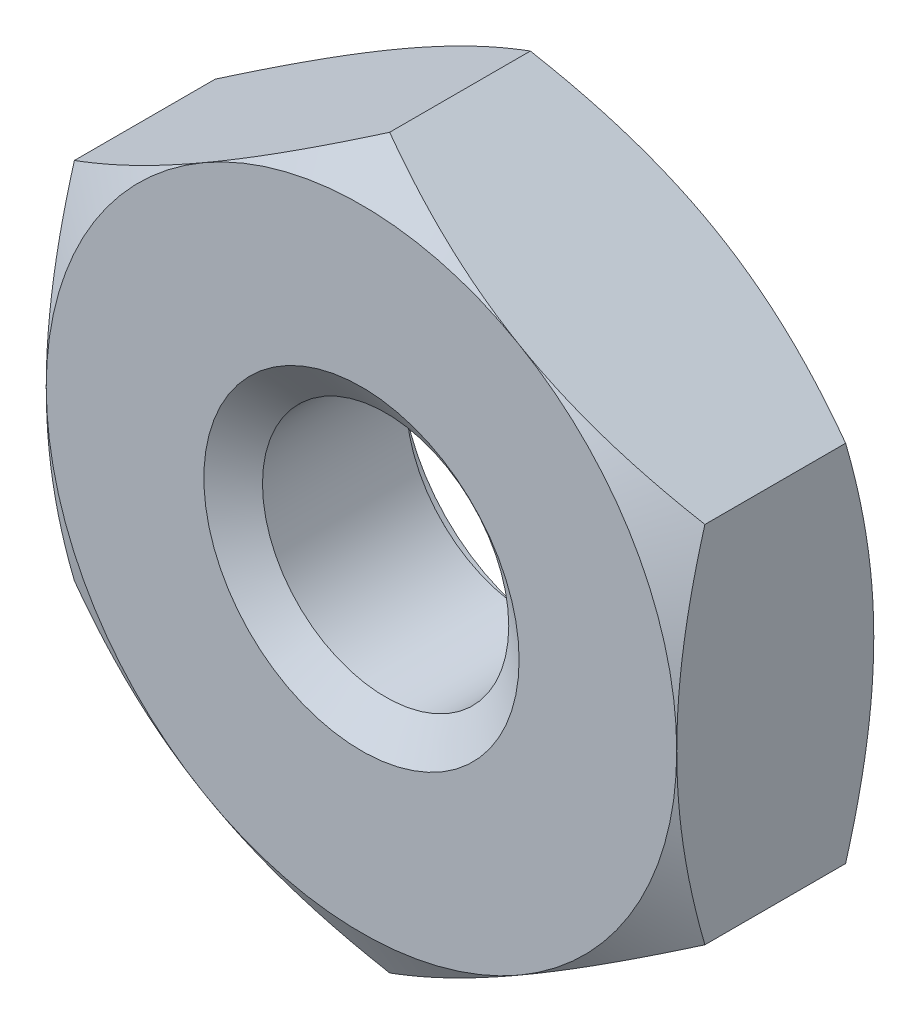
ISO-10303-21;
HEADER;
FILE_DESCRIPTION(('STEP AP214'),'2;1');
FILE_NAME('part.step','',(''),(''),'','','');
FILE_SCHEMA(('AUTOMOTIVE_DESIGN { 1 0 10303 214 1 1 1 1 }'));
ENDSEC;
DATA;
#1=APPLICATION_CONTEXT('core data for automotive mechanical design processes');
#2=APPLICATION_PROTOCOL_DEFINITION('international standard','automotive_design',2000,#1);
#3=PRODUCT_CONTEXT('',#1,'mechanical');
#4=PRODUCT('Part','Part','',(#3));
#5=PRODUCT_RELATED_PRODUCT_CATEGORY('part','',(#4));
#6=PRODUCT_DEFINITION_FORMATION('','',#4);
#7=PRODUCT_DEFINITION_CONTEXT('part definition',#1,'design');
#8=PRODUCT_DEFINITION('design','',#6,#7);
#9=PRODUCT_DEFINITION_SHAPE('','',#8);
#10=(LENGTH_UNIT() NAMED_UNIT(*) SI_UNIT(.MILLI.,.METRE.));
#11=(NAMED_UNIT(*) PLANE_ANGLE_UNIT() SI_UNIT($,.RADIAN.));
#12=(NAMED_UNIT(*) SI_UNIT($,.STERADIAN.) SOLID_ANGLE_UNIT());
#13=UNCERTAINTY_MEASURE_WITH_UNIT(LENGTH_MEASURE(1.E-05),#10,'distance_accuracy_value','');
#14=(GEOMETRIC_REPRESENTATION_CONTEXT(3) GLOBAL_UNCERTAINTY_ASSIGNED_CONTEXT((#13)) GLOBAL_UNIT_ASSIGNED_CONTEXT((#10,
#11,#12)) REPRESENTATION_CONTEXT('',''));
#15=CARTESIAN_POINT('',(0.,0.,0.));
#16=DIRECTION('',(0.,0.,1.));
#17=DIRECTION('',(1.,0.,0.));
#18=AXIS2_PLACEMENT_3D('',#15,#16,#17);
#19=CARTESIAN_POINT('',(0.,0.,-1.));
#20=DIRECTION('',(0.,0.,1.));
#21=DIRECTION('',(1.,0.,0.));
#22=AXIS2_PLACEMENT_3D('',#19,#20,#21);
#23=CYLINDRICAL_SURFACE('',#22,0.625);
#24=CARTESIAN_POINT('',(0.,0.,-0.122536319186698));
#25=DIRECTION('',(0.,0.,1.));
#26=DIRECTION('',(1.,0.,0.));
#27=AXIS2_PLACEMENT_3D('',#24,#25,#26);
#28=CIRCLE('',#27,0.625);
#29=CARTESIAN_POINT('',(0.625,0.,-0.122536319186698));
#30=VERTEX_POINT('',#29);
#31=EDGE_CURVE('E180',#30,#30,#28,.F.);
#32=ORIENTED_EDGE('',*,*,#31,.F.);
#33=EDGE_LOOP('',(#32));
#34=FACE_BOUND('',#33,.T.);
#35=CARTESIAN_POINT('',(0.,0.,-0.852063680813301));
#36=DIRECTION('',(0.,0.,-1.));
#37=DIRECTION('',(-1.,0.,0.));
#38=AXIS2_PLACEMENT_3D('',#35,#36,#37);
#39=CIRCLE('',#38,0.625);
#40=CARTESIAN_POINT('',(-0.625,0.,-0.852063680813301));
#41=VERTEX_POINT('',#40);
#42=EDGE_CURVE('E44',#41,#41,#39,.F.);
#43=ORIENTED_EDGE('',*,*,#42,.F.);
#44=EDGE_LOOP('',(#43));
#45=FACE_BOUND('',#44,.T.);
#46=ADVANCED_FACE('F39',(#34,#45),#23,.F.);
#47=CARTESIAN_POINT('',(0.,1.8475208614068,-1.));
#48=DIRECTION('',(-0.500000000000002,0.866025403784438,0.));
#49=DIRECTION('',(-0.866025403784438,-0.500000000000001,0.));
#50=AXIS2_PLACEMENT_3D('',#47,#48,#49);
#51=PLANE('',#50);
#52=DIRECTION('',(0.,0.,1.));
#53=VECTOR('',#52,1.);
#54=CARTESIAN_POINT('',(-1.6,0.923760430703399,-1.));
#55=LINE('',#54,#53);
#56=CARTESIAN_POINT('',(-1.6,0.923760430703405,-0.857093764036733));
#57=VERTEX_POINT('',#56);
#58=CARTESIAN_POINT('',(-1.6,0.923760430703399,-0.142906235963265));
#59=VERTEX_POINT('',#58);
#60=EDGE_CURVE('E170',#57,#59,#55,.T.);
#61=ORIENTED_EDGE('',*,*,#60,.T.);
#62=CARTESIAN_POINT('',(-1.6002,0.923644960649562,-0.142972908879542));
#63=CARTESIAN_POINT('',(-1.52988631454261,0.964240585876099,-0.11952386935105));
#64=CARTESIAN_POINT('',(-1.45896568981644,1.00518662765285,-0.0981973588558103));
#65=CARTESIAN_POINT('',(-1.31589622208532,1.08778782336023,-0.0609706558641361));
#66=CARTESIAN_POINT('',(-1.24374483580213,1.12944444565323,-0.0450836346469226));
#67=CARTESIAN_POINT('',(-1.10033630057878,1.21224140206853,-0.0203517145647476));
#68=CARTESIAN_POINT('',(-1.02910122444319,1.25336899245115,-0.0113422364016103));
#69=CARTESIAN_POINT('',(-0.886295665767103,1.33581782019457,-0.000584271243997045));
#70=CARTESIAN_POINT('',(-0.814725702734542,1.37713875761731,0.00117312160481527));
#71=CARTESIAN_POINT('',(-0.680978543862274,1.45435771579556,-0.00247117305863149));
#72=CARTESIAN_POINT('',(-0.618781387401735,1.49026726082088,-0.0069780590876111));
#73=CARTESIAN_POINT('',(-0.494792313483937,1.56185238602389,-0.0212658761938087));
#74=CARTESIAN_POINT('',(-0.433000825294996,1.59752771836341,-0.0310516940962126));
#75=CARTESIAN_POINT('',(-0.308755841646641,1.66926059311825,-0.0555169113294943));
#76=CARTESIAN_POINT('',(-0.246318081755429,1.70530905059903,-0.0703000799228597));
#77=CARTESIAN_POINT('',(-0.122374128162257,1.77686812557048,-0.10385260778329));
#78=CARTESIAN_POINT('',(-0.0608663449577961,1.81237966076083,-0.122614076743965));
#79=CARTESIAN_POINT('',(0.000199999999999744,1.84763633146064,-0.142972908879543));
#80=B_SPLINE_CURVE_WITH_KNOTS('',3,(#62,#63,#64,#65,#66,#67,#68,#69,#70,#71,#72,#73,#74,#75,#76,
#77,#78,#79),.UNSPECIFIED.,.F.,.F.,(4,2,2,2,2,2,2,2,4),(0.,0.253628622662481,0.507867113505243,
0.755812447259193,1.00345320332839,1.21912891721902,1.43500463041921,1.65567058644228,
1.87590291418786),.UNSPECIFIED.);
#81=CARTESIAN_POINT('',(-0.800000000000002,1.3856406460551,0.));
#82=VERTEX_POINT('',#81);
#83=EDGE_CURVE('E66',#59,#82,#80,.T.);
#84=ORIENTED_EDGE('',*,*,#83,.T.);
#85=CARTESIAN_POINT('',(0.,1.8475208614068,-0.142906235963267));
#86=VERTEX_POINT('',#85);
#87=EDGE_CURVE('E249',#82,#86,#80,.T.);
#88=ORIENTED_EDGE('',*,*,#87,.T.);
#89=DIRECTION('',(0.,0.,1.));
#90=VECTOR('',#89,1.);
#91=CARTESIAN_POINT('',(0.,1.8475208614068,-1.));
#92=LINE('',#91,#90);
#93=CARTESIAN_POINT('',(0.,1.8475208614068,-0.857093764036733));
#94=VERTEX_POINT('',#93);
#95=EDGE_CURVE('E155',#94,#86,#92,.T.);
#96=ORIENTED_EDGE('',*,*,#95,.F.);
#97=CARTESIAN_POINT('',(-1.6002,0.923644960649562,-0.857027091120458));
#98=CARTESIAN_POINT('',(-1.52988631454261,0.964240585876099,-0.88047613064895));
#99=CARTESIAN_POINT('',(-1.45896568981644,1.00518662765285,-0.90180264114419));
#100=CARTESIAN_POINT('',(-1.31589622208532,1.08778782336023,-0.939029344135864));
#101=CARTESIAN_POINT('',(-1.24374483580213,1.12944444565323,-0.954916365353078));
#102=CARTESIAN_POINT('',(-1.10033630057878,1.21224140206853,-0.979648285435252));
#103=CARTESIAN_POINT('',(-1.02910122444319,1.25336899245115,-0.98865776359839));
#104=CARTESIAN_POINT('',(-0.886295665767103,1.33581782019457,-0.999415728756003));
#105=CARTESIAN_POINT('',(-0.814725702734542,1.37713875761731,-1.00117312160482));
#106=CARTESIAN_POINT('',(-0.680978543862274,1.45435771579556,-0.997528826941369));
#107=CARTESIAN_POINT('',(-0.618781387401735,1.49026726082088,-0.993021940912389));
#108=CARTESIAN_POINT('',(-0.494792313483937,1.56185238602389,-0.978734123806191));
#109=CARTESIAN_POINT('',(-0.433000825294996,1.59752771836341,-0.968948305903787));
#110=CARTESIAN_POINT('',(-0.308755841646641,1.66926059311825,-0.944483088670506));
#111=CARTESIAN_POINT('',(-0.246318081755429,1.70530905059903,-0.92969992007714));
#112=CARTESIAN_POINT('',(-0.122374128162257,1.77686812557048,-0.89614739221671));
#113=CARTESIAN_POINT('',(-0.0608663449577961,1.81237966076083,-0.877385923256035));
#114=CARTESIAN_POINT('',(0.000199999999999745,1.84763633146064,-0.857027091120457));
#115=B_SPLINE_CURVE_WITH_KNOTS('',3,(#97,#98,#99,#100,#101,#102,#103,#104,#105,#106,#107,#108,
#109,#110,#111,#112,#113,#114),.UNSPECIFIED.,.F.,.F.,(4,2,2,2,2,2,2,2,4),(0.,0.253628622662481,
0.507867113505243,0.755812447259193,1.00345320332839,1.21912891721902,1.43500463041921,
1.65567058644228,1.87590291418786),.UNSPECIFIED.);
#116=CARTESIAN_POINT('',(-0.800000000000002,1.3856406460551,-1.));
#117=VERTEX_POINT('',#116);
#118=EDGE_CURVE('E173',#117,#94,#115,.T.);
#119=ORIENTED_EDGE('',*,*,#118,.F.);
#120=EDGE_CURVE('E272',#57,#117,#115,.T.);
#121=ORIENTED_EDGE('',*,*,#120,.F.);
#122=EDGE_LOOP('',(#61,#84,#88,#96,#119,#121));
#123=FACE_BOUND('',#122,.T.);
#124=ADVANCED_FACE('F41',(#123),#51,.T.);
#125=CARTESIAN_POINT('',(1.6,0.923760430703399,-1.));
#126=DIRECTION('',(0.500000000000001,0.866025403784438,0.));
#127=DIRECTION('',(-0.866025403784438,0.500000000000001,0.));
#128=AXIS2_PLACEMENT_3D('',#125,#126,#127);
#129=PLANE('',#128);
#130=ORIENTED_EDGE('',*,*,#95,.T.);
#131=CARTESIAN_POINT('',(-0.000200000000000168,1.84763633146064,-0.142972908879543));
#132=CARTESIAN_POINT('',(0.0701136854573875,1.8070407062341,-0.119523869351051));
#133=CARTESIAN_POINT('',(0.141034310183559,1.76609466445735,-0.0981973588558114));
#134=CARTESIAN_POINT('',(0.284103777914677,1.68349346874998,-0.060970655864137));
#135=CARTESIAN_POINT('',(0.356255164197866,1.64183684645697,-0.0450836346469235));
#136=CARTESIAN_POINT('',(0.499663699421223,1.55903989004168,-0.0203517145647482));
#137=CARTESIAN_POINT('',(0.570898775556807,1.51791229965905,-0.0113422364016106));
#138=CARTESIAN_POINT('',(0.713704334232897,1.43546347191564,-0.00058427124399693));
#139=CARTESIAN_POINT('',(0.785274297265459,1.3941425344929,0.00117312160481539));
#140=CARTESIAN_POINT('',(0.919021456137727,1.31692357631464,-0.00247117305863125));
#141=CARTESIAN_POINT('',(0.981218612598265,1.28101403128932,-0.00697805908761074));
#142=CARTESIAN_POINT('',(1.10520768651606,1.20942890608631,-0.0212658761938081));
#143=CARTESIAN_POINT('',(1.166999174705,1.1737535737468,-0.0310516940962118));
#144=CARTESIAN_POINT('',(1.29124415835336,1.10202069899196,-0.0555169113294932));
#145=CARTESIAN_POINT('',(1.35368191824457,1.06597224151117,-0.0703000799228585));
#146=CARTESIAN_POINT('',(1.47762587183774,0.994413166539725,-0.103852607783289));
#147=CARTESIAN_POINT('',(1.5391336550422,0.958901631349372,-0.122614076743964));
#148=CARTESIAN_POINT('',(1.6002,0.923644960649562,-0.142972908879541));
#149=B_SPLINE_CURVE_WITH_KNOTS('',3,(#131,#132,#133,#134,#135,#136,#137,#138,#139,#140,#141,
#142,#143,#144,#145,#146,#147,#148),.UNSPECIFIED.,.F.,.F.,(4,2,2,2,2,2,2,2,4),(0.,
0.253628622662481,0.507867113505244,0.755812447259194,1.0034532033284,1.21912891721902,
1.43500463041921,1.65567058644228,1.87590291418786),.UNSPECIFIED.);
#150=CARTESIAN_POINT('',(0.800000000000002,1.3856406460551,0.));
#151=VERTEX_POINT('',#150);
#152=EDGE_CURVE('E148',#86,#151,#149,.T.);
#153=ORIENTED_EDGE('',*,*,#152,.T.);
#154=CARTESIAN_POINT('',(1.6,0.923760430703405,-0.142906235963267));
#155=VERTEX_POINT('',#154);
#156=EDGE_CURVE('E134',#151,#155,#149,.T.);
#157=ORIENTED_EDGE('',*,*,#156,.T.);
#158=DIRECTION('',(0.,0.,1.));
#159=VECTOR('',#158,1.);
#160=CARTESIAN_POINT('',(1.6,0.923760430703399,-1.));
#161=LINE('',#160,#159);
#162=CARTESIAN_POINT('',(1.6,0.923760430703405,-0.857093764036733));
#163=VERTEX_POINT('',#162);
#164=EDGE_CURVE('E147',#163,#155,#161,.T.);
#165=ORIENTED_EDGE('',*,*,#164,.F.);
#166=CARTESIAN_POINT('',(-0.000200000000000168,1.84763633146064,-0.857027091120457));
#167=CARTESIAN_POINT('',(0.0701136854573876,1.8070407062341,-0.880476130648949));
#168=CARTESIAN_POINT('',(0.141034310183559,1.76609466445735,-0.901802641144189));
#169=CARTESIAN_POINT('',(0.284103777914677,1.68349346874998,-0.939029344135863));
#170=CARTESIAN_POINT('',(0.356255164197866,1.64183684645697,-0.954916365353077));
#171=CARTESIAN_POINT('',(0.499663699421224,1.55903989004168,-0.979648285435252));
#172=CARTESIAN_POINT('',(0.570898775556807,1.51791229965905,-0.988657763598389));
#173=CARTESIAN_POINT('',(0.713704334232898,1.43546347191564,-0.999415728756003));
#174=CARTESIAN_POINT('',(0.785274297265459,1.3941425344929,-1.00117312160482));
#175=CARTESIAN_POINT('',(0.919021456137727,1.31692357631464,-0.997528826941369));
#176=CARTESIAN_POINT('',(0.981218612598265,1.28101403128932,-0.993021940912389));
#177=CARTESIAN_POINT('',(1.10520768651606,1.20942890608631,-0.978734123806192));
#178=CARTESIAN_POINT('',(1.166999174705,1.1737535737468,-0.968948305903788));
#179=CARTESIAN_POINT('',(1.29124415835336,1.10202069899196,-0.944483088670507));
#180=CARTESIAN_POINT('',(1.35368191824457,1.06597224151117,-0.929699920077142));
#181=CARTESIAN_POINT('',(1.47762587183774,0.994413166539724,-0.896147392216711));
#182=CARTESIAN_POINT('',(1.5391336550422,0.958901631349371,-0.877385923256036));
#183=CARTESIAN_POINT('',(1.6002,0.923644960649562,-0.857027091120459));
#184=B_SPLINE_CURVE_WITH_KNOTS('',3,(#166,#167,#168,#169,#170,#171,#172,#173,#174,#175,#176,
#177,#178,#179,#180,#181,#182,#183),.UNSPECIFIED.,.F.,.F.,(4,2,2,2,2,2,2,2,4),(0.,
0.253628622662481,0.507867113505244,0.755812447259194,1.0034532033284,1.21912891721902,
1.43500463041921,1.65567058644228,1.87590291418786),.UNSPECIFIED.);
#185=CARTESIAN_POINT('',(0.800000000000002,1.3856406460551,-1.));
#186=VERTEX_POINT('',#185);
#187=EDGE_CURVE('E265',#186,#163,#184,.T.);
#188=ORIENTED_EDGE('',*,*,#187,.F.);
#189=EDGE_CURVE('E271',#94,#186,#184,.T.);
#190=ORIENTED_EDGE('',*,*,#189,.F.);
#191=EDGE_LOOP('',(#130,#153,#157,#165,#188,#190));
#192=FACE_BOUND('',#191,.T.);
#193=ADVANCED_FACE('F145',(#192),#129,.T.);
#194=CARTESIAN_POINT('',(1.6,0.923760430703399,-1.));
#195=DIRECTION('',(-1.,0.,0.));
#196=DIRECTION('',(0.,0.,1.));
#197=AXIS2_PLACEMENT_3D('',#194,#195,#196);
#198=PLANE('',#197);
#199=CARTESIAN_POINT('',(1.6,-2.44994879598357,-0.765642728496259));
#200=CARTESIAN_POINT('',(1.6,-2.37969974814163,-0.731694508327917));
#201=CARTESIAN_POINT('',(1.6,-2.30928460837461,-0.69808376153354));
#202=CARTESIAN_POINT('',(1.6,-2.16803233911836,-0.631730058708288));
#203=CARTESIAN_POINT('',(1.6,-2.09719513913279,-0.598987252925733));
#204=CARTESIAN_POINT('',(1.6,-1.95462628673218,-0.534389785244708));
#205=CARTESIAN_POINT('',(1.6,-1.8828918355113,-0.502541278099893));
#206=CARTESIAN_POINT('',(1.6,-1.73883333903521,-0.440212234093449));
#207=CARTESIAN_POINT('',(1.6,-1.6665093247456,-0.409731625925812));
#208=CARTESIAN_POINT('',(1.6,-1.52025911131041,-0.350140376362839));
#209=CARTESIAN_POINT('',(1.6,-1.44632414246221,-0.321051139719715));
#210=CARTESIAN_POINT('',(1.6,-1.29758156645315,-0.265150698697262));
#211=CARTESIAN_POINT('',(1.6,-1.22277385663729,-0.238339765436293));
#212=CARTESIAN_POINT('',(1.6,-1.07232436571228,-0.187717744432215));
#213=CARTESIAN_POINT('',(1.6,-0.996684796742376,-0.16390014938712));
#214=CARTESIAN_POINT('',(1.6,-0.84432415402259,-0.120034982590466));
#215=CARTESIAN_POINT('',(1.6,-0.767603338043493,-0.0999865280833132));
#216=CARTESIAN_POINT('',(1.6,-0.613036885171955,-0.0646363619078523));
#217=CARTESIAN_POINT('',(1.6,-0.535190999347726,-0.0493357180986317));
#218=CARTESIAN_POINT('',(1.6,-0.378561259128046,-0.0245095306527776));
#219=CARTESIAN_POINT('',(1.6,-0.299777403903375,-0.0149839921220631));
#220=CARTESIAN_POINT('',(1.6,-0.142180170377903,-0.00255333229477238));
#221=CARTESIAN_POINT('',(1.6,-0.0633701971665521,0.00039370155247894));
#222=CARTESIAN_POINT('',(1.6,0.0941865075761135,-0.000479368384373406));
#223=CARTESIAN_POINT('',(1.6,0.172933250213998,-0.00429771555629666));
#224=CARTESIAN_POINT('',(1.6,0.363437778602548,-0.0213794511304663));
#225=CARTESIAN_POINT('',(1.6,0.474896382255892,-0.0379863535114732));
#226=CARTESIAN_POINT('',(1.6,0.695751445002753,-0.0817595954163213));
#227=CARTESIAN_POINT('',(1.6,0.805145318543974,-0.108938358499322));
#228=CARTESIAN_POINT('',(1.6,0.968869652923255,-0.15580715652431));
#229=CARTESIAN_POINT('',(1.6,1.02403724151603,-0.172685741626058));
#230=CARTESIAN_POINT('',(1.6,1.13379353971654,-0.208113667302657));
#231=CARTESIAN_POINT('',(1.6,1.18838261996598,-0.226661855504924));
#232=CARTESIAN_POINT('',(1.6,1.29675750604283,-0.265042326377577));
#233=CARTESIAN_POINT('',(1.6,1.35054610375004,-0.284866793658882));
#234=CARTESIAN_POINT('',(1.6,1.45770597270107,-0.325679318149292));
#235=CARTESIAN_POINT('',(1.6,1.51107706518851,-0.34666784564186));
#236=CARTESIAN_POINT('',(1.6,1.56425479594673,-0.368123602616717));
#237=B_SPLINE_CURVE_WITH_KNOTS('',3,(#199,#200,#201,#202,#203,#204,#205,#206,#207,#208,#209,
#210,#211,#212,#213,#214,#215,#216,#217,#218,#219,#220,#221,#222,#223,#224,#225,#226,#227,#228,
#229,#230,#231,#232,#233,#234,#235,#236),.UNSPECIFIED.,.F.,.F.,(4,2,2,2,2,2,2,2,2,2,2,2,2,2,2,2,
2,2,4),(0.,0.234068717012908,0.468177692239707,0.703626378583959,0.939062777139308,
1.17738868236875,1.41574290880726,1.65356966173644,1.89134064461681,2.1291650673223,
2.36698970029417,2.60329474246707,2.83953843769047,3.1769134235551,3.51468608047105,
3.68774124262249,3.86067786349693,4.03264108088362,4.20467428524161),.UNSPECIFIED.);
#238=CARTESIAN_POINT('',(1.6,-0.923760430703405,-0.142906235963267));
#239=VERTEX_POINT('',#238);
#240=CARTESIAN_POINT('',(1.6,0.,0.));
#241=VERTEX_POINT('',#240);
#242=EDGE_CURVE('E140',#239,#241,#237,.T.);
#243=ORIENTED_EDGE('',*,*,#242,.F.);
#244=DIRECTION('',(0.,0.,1.));
#245=VECTOR('',#244,1.);
#246=CARTESIAN_POINT('',(1.6,-0.923760430703405,-1.));
#247=LINE('',#246,#245);
#248=CARTESIAN_POINT('',(1.6,-0.923760430703405,-0.857093764036733));
#249=VERTEX_POINT('',#248);
#250=EDGE_CURVE('E156',#249,#239,#247,.T.);
#251=ORIENTED_EDGE('',*,*,#250,.F.);
#252=CARTESIAN_POINT('',(1.6,-2.44994879598357,-0.234357271503741));
#253=CARTESIAN_POINT('',(1.6,-2.37969974814163,-0.268305491672083));
#254=CARTESIAN_POINT('',(1.6,-2.30928460837461,-0.30191623846646));
#255=CARTESIAN_POINT('',(1.6,-2.16803233911836,-0.368269941291712));
#256=CARTESIAN_POINT('',(1.6,-2.09719513913279,-0.401012747074267));
#257=CARTESIAN_POINT('',(1.6,-1.95462628673218,-0.465610214755292));
#258=CARTESIAN_POINT('',(1.6,-1.8828918355113,-0.497458721900107));
#259=CARTESIAN_POINT('',(1.6,-1.73883333903521,-0.559787765906551));
#260=CARTESIAN_POINT('',(1.6,-1.6665093247456,-0.590268374074188));
#261=CARTESIAN_POINT('',(1.6,-1.52025911131041,-0.649859623637161));
#262=CARTESIAN_POINT('',(1.6,-1.44632414246221,-0.678948860280285));
#263=CARTESIAN_POINT('',(1.6,-1.29758156645315,-0.734849301302738));
#264=CARTESIAN_POINT('',(1.6,-1.22277385663729,-0.761660234563707));
#265=CARTESIAN_POINT('',(1.6,-1.07232436571228,-0.812282255567785));
#266=CARTESIAN_POINT('',(1.6,-0.996684796742376,-0.83609985061288));
#267=CARTESIAN_POINT('',(1.6,-0.844324154022591,-0.879965017409534));
#268=CARTESIAN_POINT('',(1.6,-0.767603338043493,-0.900013471916687));
#269=CARTESIAN_POINT('',(1.6,-0.613036885171955,-0.935363638092148));
#270=CARTESIAN_POINT('',(1.6,-0.535190999347726,-0.950664281901368));
#271=CARTESIAN_POINT('',(1.6,-0.378561259128046,-0.975490469347222));
#272=CARTESIAN_POINT('',(1.6,-0.299777403903375,-0.985016007877937));
#273=CARTESIAN_POINT('',(1.6,-0.142180170377903,-0.997446667705228));
#274=CARTESIAN_POINT('',(1.6,-0.0633701971665521,-1.00039370155248));
#275=CARTESIAN_POINT('',(1.6,0.0941865075761135,-0.999520631615627));
#276=CARTESIAN_POINT('',(1.6,0.172933250213998,-0.995702284443703));
#277=CARTESIAN_POINT('',(1.6,0.363437778602548,-0.978620548869534));
#278=CARTESIAN_POINT('',(1.6,0.474896382255892,-0.962013646488527));
#279=CARTESIAN_POINT('',(1.6,0.695751445002753,-0.918240404583679));
#280=CARTESIAN_POINT('',(1.6,0.805145318543974,-0.891061641500678));
#281=CARTESIAN_POINT('',(1.6,0.968869652923256,-0.84419284347569));
#282=CARTESIAN_POINT('',(1.6,1.02403724151604,-0.827314258373941));
#283=CARTESIAN_POINT('',(1.6,1.13379353971654,-0.791886332697343));
#284=CARTESIAN_POINT('',(1.6,1.18838261996598,-0.773338144495076));
#285=CARTESIAN_POINT('',(1.6,1.29675750604283,-0.734957673622423));
#286=CARTESIAN_POINT('',(1.6,1.35054610375004,-0.715133206341118));
#287=CARTESIAN_POINT('',(1.6,1.45770597270107,-0.674320681850708));
#288=CARTESIAN_POINT('',(1.6,1.51107706518851,-0.65333215435814));
#289=CARTESIAN_POINT('',(1.6,1.56425479594673,-0.631876397383283));
#290=B_SPLINE_CURVE_WITH_KNOTS('',3,(#252,#253,#254,#255,#256,#257,#258,#259,#260,#261,#262,
#263,#264,#265,#266,#267,#268,#269,#270,#271,#272,#273,#274,#275,#276,#277,#278,#279,#280,#281,
#282,#283,#284,#285,#286,#287,#288,#289),.UNSPECIFIED.,.F.,.F.,(4,2,2,2,2,2,2,2,2,2,2,2,2,2,2,2,
2,2,4),(0.,0.234068717012908,0.468177692239707,0.703626378583959,0.939062777139308,
1.17738868236875,1.41574290880726,1.65356966173644,1.89134064461681,2.1291650673223,
2.36698970029417,2.60329474246707,2.83953843769047,3.1769134235551,3.51468608047106,
3.68774124262249,3.86067786349693,4.03264108088362,4.20467428524161),.UNSPECIFIED.);
#291=CARTESIAN_POINT('',(1.6,0.,-1.));
#292=VERTEX_POINT('',#291);
#293=EDGE_CURVE('E278',#249,#292,#290,.T.);
#294=ORIENTED_EDGE('',*,*,#293,.T.);
#295=EDGE_CURVE('E154',#292,#163,#290,.T.);
#296=ORIENTED_EDGE('',*,*,#295,.T.);
#297=ORIENTED_EDGE('',*,*,#164,.T.);
#298=EDGE_CURVE('E131',#241,#155,#237,.T.);
#299=ORIENTED_EDGE('',*,*,#298,.F.);
#300=EDGE_LOOP('',(#243,#251,#294,#296,#297,#299));
#301=FACE_BOUND('',#300,.T.);
#302=ADVANCED_FACE('F151',(#301),#198,.F.);
#303=CARTESIAN_POINT('',(0.,-1.84752086140681,-1.));
#304=DIRECTION('',(0.500000000000001,-0.866025403784438,0.));
#305=DIRECTION('',(0.866025403784438,0.500000000000001,0.));
#306=AXIS2_PLACEMENT_3D('',#303,#304,#305);
#307=PLANE('',#306);
#308=ORIENTED_EDGE('',*,*,#250,.T.);
#309=CARTESIAN_POINT('',(1.6002,-0.923644960649567,-0.142972908879543));
#310=CARTESIAN_POINT('',(1.52988631454261,-0.964240585876105,-0.119523869351051));
#311=CARTESIAN_POINT('',(1.45896568981644,-1.00518662765286,-0.0981973588558122));
#312=CARTESIAN_POINT('',(1.31589622208532,-1.08778782336023,-0.0609706558641381));
#313=CARTESIAN_POINT('',(1.24374483580213,-1.12944444565324,-0.0450836346469247));
#314=CARTESIAN_POINT('',(1.10033630057878,-1.21224140206853,-0.0203517145647499));
#315=CARTESIAN_POINT('',(1.02910122444319,-1.25336899245116,-0.0113422364016127));
#316=CARTESIAN_POINT('',(0.886295665767102,-1.33581782019457,-0.00058427124399964));
#317=CARTESIAN_POINT('',(0.81472570273454,-1.37713875761731,0.0011731216048125));
#318=CARTESIAN_POINT('',(0.680978543862272,-1.45435771579557,-0.00247117305863447));
#319=CARTESIAN_POINT('',(0.618781387401734,-1.49026726082089,-0.00697805908761411));
#320=CARTESIAN_POINT('',(0.494792313483936,-1.5618523860239,-0.0212658761938119));
#321=CARTESIAN_POINT('',(0.433000825294996,-1.59752771836341,-0.0310516940962159));
#322=CARTESIAN_POINT('',(0.308755841646641,-1.66926059311825,-0.0555169113294976));
#323=CARTESIAN_POINT('',(0.246318081755429,-1.70530905059904,-0.070300079922863));
#324=CARTESIAN_POINT('',(0.122374128162257,-1.77686812557048,-0.103852607783294));
#325=CARTESIAN_POINT('',(0.0608663449577959,-1.81237966076084,-0.122614076743968));
#326=CARTESIAN_POINT('',(-0.000199999999999667,-1.84763633146065,-0.142972908879546));
#327=B_SPLINE_CURVE_WITH_KNOTS('',3,(#309,#310,#311,#312,#313,#314,#315,#316,#317,#318,#319,
#320,#321,#322,#323,#324,#325,#326),.UNSPECIFIED.,.F.,.F.,(4,2,2,2,2,2,2,2,4),(0.,
0.253628622662481,0.507867113505244,0.755812447259194,1.0034532033284,1.21912891721902,
1.43500463041921,1.65567058644228,1.87590291418786),.UNSPECIFIED.);
#328=CARTESIAN_POINT('',(0.800000000000002,-1.3856406460551,0.));
#329=VERTEX_POINT('',#328);
#330=EDGE_CURVE('E553',#239,#329,#327,.T.);
#331=ORIENTED_EDGE('',*,*,#330,.T.);
#332=CARTESIAN_POINT('',(0.,-1.8475208614068,-0.142906235963267));
#333=VERTEX_POINT('',#332);
#334=EDGE_CURVE('E233',#329,#333,#327,.T.);
#335=ORIENTED_EDGE('',*,*,#334,.T.);
#336=DIRECTION('',(0.,0.,1.));
#337=VECTOR('',#336,1.);
#338=CARTESIAN_POINT('',(0.,-1.84752086140681,-1.));
#339=LINE('',#338,#337);
#340=CARTESIAN_POINT('',(0.,-1.8475208614068,-0.857093764036733));
#341=VERTEX_POINT('',#340);
#342=EDGE_CURVE('E161',#341,#333,#339,.T.);
#343=ORIENTED_EDGE('',*,*,#342,.F.);
#344=CARTESIAN_POINT('',(1.6002,-0.923644960649567,-0.857027091120457));
#345=CARTESIAN_POINT('',(1.52988631454261,-0.964240585876105,-0.880476130648949));
#346=CARTESIAN_POINT('',(1.45896568981644,-1.00518662765286,-0.901802641144188));
#347=CARTESIAN_POINT('',(1.31589622208532,-1.08778782336023,-0.939029344135862));
#348=CARTESIAN_POINT('',(1.24374483580213,-1.12944444565324,-0.954916365353075));
#349=CARTESIAN_POINT('',(1.10033630057878,-1.21224140206853,-0.97964828543525));
#350=CARTESIAN_POINT('',(1.02910122444319,-1.25336899245116,-0.988657763598387));
#351=CARTESIAN_POINT('',(0.886295665767102,-1.33581782019457,-0.999415728756));
#352=CARTESIAN_POINT('',(0.81472570273454,-1.37713875761731,-1.00117312160481));
#353=CARTESIAN_POINT('',(0.680978543862272,-1.45435771579557,-0.997528826941366));
#354=CARTESIAN_POINT('',(0.618781387401734,-1.49026726082089,-0.993021940912386));
#355=CARTESIAN_POINT('',(0.494792313483935,-1.5618523860239,-0.978734123806188));
#356=CARTESIAN_POINT('',(0.433000825294996,-1.59752771836341,-0.968948305903784));
#357=CARTESIAN_POINT('',(0.308755841646641,-1.66926059311825,-0.944483088670502));
#358=CARTESIAN_POINT('',(0.246318081755429,-1.70530905059904,-0.929699920077137));
#359=CARTESIAN_POINT('',(0.122374128162257,-1.77686812557048,-0.896147392216706));
#360=CARTESIAN_POINT('',(0.0608663449577958,-1.81237966076084,-0.877385923256032));
#361=CARTESIAN_POINT('',(-0.000199999999999889,-1.84763633146065,-0.857027091120454));
#362=B_SPLINE_CURVE_WITH_KNOTS('',3,(#344,#345,#346,#347,#348,#349,#350,#351,#352,#353,#354,
#355,#356,#357,#358,#359,#360,#361),.UNSPECIFIED.,.F.,.F.,(4,2,2,2,2,2,2,2,4),(0.,
0.253628622662481,0.507867113505244,0.755812447259194,1.0034532033284,1.21912891721902,
1.43500463041921,1.65567058644228,1.87590291418786),.UNSPECIFIED.);
#363=CARTESIAN_POINT('',(0.800000000000002,-1.3856406460551,-1.));
#364=VERTEX_POINT('',#363);
#365=EDGE_CURVE('E285',#364,#341,#362,.T.);
#366=ORIENTED_EDGE('',*,*,#365,.F.);
#367=EDGE_CURVE('E284',#249,#364,#362,.T.);
#368=ORIENTED_EDGE('',*,*,#367,.F.);
#369=EDGE_LOOP('',(#308,#331,#335,#343,#366,#368));
#370=FACE_BOUND('',#369,.T.);
#371=ADVANCED_FACE('F297',(#370),#307,.T.);
#372=CARTESIAN_POINT('',(-1.6,-0.923760430703405,-1.));
#373=DIRECTION('',(-0.500000000000001,-0.866025403784438,0.));
#374=DIRECTION('',(0.866025403784438,-0.500000000000001,0.));
#375=AXIS2_PLACEMENT_3D('',#372,#373,#374);
#376=PLANE('',#375);
#377=ORIENTED_EDGE('',*,*,#342,.T.);
#378=CARTESIAN_POINT('',(0.000200000000000031,-1.84763633146065,-0.142972908879546));
#379=CARTESIAN_POINT('',(-0.070113685457388,-1.80704070623411,-0.119523869351054));
#380=CARTESIAN_POINT('',(-0.141034310183559,-1.76609466445736,-0.0981973588558147));
#381=CARTESIAN_POINT('',(-0.284103777914678,-1.68349346874998,-0.0609706558641401));
#382=CARTESIAN_POINT('',(-0.356255164197867,-1.64183684645698,-0.0450836346469264));
#383=CARTESIAN_POINT('',(-0.499663699421225,-1.55903989004168,-0.0203517145647511));
#384=CARTESIAN_POINT('',(-0.570898775556809,-1.51791229965906,-0.0113422364016136));
#385=CARTESIAN_POINT('',(-0.7137043342329,-1.43546347191564,-0.000584271243999851));
#386=CARTESIAN_POINT('',(-0.785274297265462,-1.3941425344929,0.00117312160481263));
#387=CARTESIAN_POINT('',(-0.91902145613773,-1.31692357631465,-0.00247117305863398));
#388=CARTESIAN_POINT('',(-0.981218612598268,-1.28101403128933,-0.00697805908761353));
#389=CARTESIAN_POINT('',(-1.10520768651607,-1.20942890608631,-0.0212658761938108));
#390=CARTESIAN_POINT('',(-1.16699917470501,-1.1737535737468,-0.0310516940962144));
#391=CARTESIAN_POINT('',(-1.29124415835336,-1.10202069899196,-0.0555169113294956));
#392=CARTESIAN_POINT('',(-1.35368191824457,-1.06597224151117,-0.0703000799228608));
#393=CARTESIAN_POINT('',(-1.47762587183774,-0.99441316653973,-0.103852607783291));
#394=CARTESIAN_POINT('',(-1.5391336550422,-0.958901631349377,-0.122614076743966));
#395=CARTESIAN_POINT('',(-1.6002,-0.923644960649567,-0.142972908879543));
#396=B_SPLINE_CURVE_WITH_KNOTS('',3,(#378,#379,#380,#381,#382,#383,#384,#385,#386,#387,#388,
#389,#390,#391,#392,#393,#394,#395),.UNSPECIFIED.,.F.,.F.,(4,2,2,2,2,2,2,2,4),(0.,
0.253628622662482,0.507867113505246,0.755812447259197,1.0034532033284,1.21912891721902,
1.43500463041921,1.65567058644228,1.87590291418786),.UNSPECIFIED.);
#397=CARTESIAN_POINT('',(-0.800000000000002,-1.3856406460551,0.));
#398=VERTEX_POINT('',#397);
#399=EDGE_CURVE('E551',#333,#398,#396,.T.);
#400=ORIENTED_EDGE('',*,*,#399,.T.);
#401=CARTESIAN_POINT('',(-1.6,-0.923760430703405,-0.142906235963267));
#402=VERTEX_POINT('',#401);
#403=EDGE_CURVE('E205',#398,#402,#396,.T.);
#404=ORIENTED_EDGE('',*,*,#403,.T.);
#405=DIRECTION('',(0.,0.,1.));
#406=VECTOR('',#405,1.);
#407=CARTESIAN_POINT('',(-1.6,-0.923760430703405,-1.));
#408=LINE('',#407,#406);
#409=CARTESIAN_POINT('',(-1.6,-0.923760430703405,-0.857093764036733));
#410=VERTEX_POINT('',#409);
#411=EDGE_CURVE('E167',#410,#402,#408,.T.);
#412=ORIENTED_EDGE('',*,*,#411,.F.);
#413=CARTESIAN_POINT('',(0.000200000000000062,-1.84763633146065,-0.857027091120454));
#414=CARTESIAN_POINT('',(-0.070113685457388,-1.80704070623411,-0.880476130648946));
#415=CARTESIAN_POINT('',(-0.141034310183559,-1.76609466445736,-0.901802641144185));
#416=CARTESIAN_POINT('',(-0.284103777914678,-1.68349346874998,-0.93902934413586));
#417=CARTESIAN_POINT('',(-0.356255164197867,-1.64183684645698,-0.954916365353074));
#418=CARTESIAN_POINT('',(-0.499663699421225,-1.55903989004168,-0.979648285435249));
#419=CARTESIAN_POINT('',(-0.570898775556809,-1.51791229965906,-0.988657763598386));
#420=CARTESIAN_POINT('',(-0.7137043342329,-1.43546347191564,-0.999415728756));
#421=CARTESIAN_POINT('',(-0.785274297265461,-1.3941425344929,-1.00117312160481));
#422=CARTESIAN_POINT('',(-0.919021456137729,-1.31692357631465,-0.997528826941366));
#423=CARTESIAN_POINT('',(-0.981218612598267,-1.28101403128933,-0.993021940912387));
#424=CARTESIAN_POINT('',(-1.10520768651607,-1.20942890608631,-0.978734123806189));
#425=CARTESIAN_POINT('',(-1.16699917470501,-1.1737535737468,-0.968948305903786));
#426=CARTESIAN_POINT('',(-1.29124415835336,-1.10202069899196,-0.944483088670504));
#427=CARTESIAN_POINT('',(-1.35368191824457,-1.06597224151117,-0.929699920077139));
#428=CARTESIAN_POINT('',(-1.47762587183774,-0.99441316653973,-0.896147392216709));
#429=CARTESIAN_POINT('',(-1.5391336550422,-0.958901631349377,-0.877385923256034));
#430=CARTESIAN_POINT('',(-1.6002,-0.923644960649567,-0.857027091120457));
#431=B_SPLINE_CURVE_WITH_KNOTS('',3,(#413,#414,#415,#416,#417,#418,#419,#420,#421,#422,#423,
#424,#425,#426,#427,#428,#429,#430),.UNSPECIFIED.,.F.,.F.,(4,2,2,2,2,2,2,2,4),(0.,
0.253628622662481,0.507867113505245,0.755812447259196,1.0034532033284,1.21912891721902,
1.43500463041921,1.65567058644228,1.87590291418786),.UNSPECIFIED.);
#432=CARTESIAN_POINT('',(-0.800000000000002,-1.3856406460551,-1.));
#433=VERTEX_POINT('',#432);
#434=EDGE_CURVE('E292',#433,#410,#431,.T.);
#435=ORIENTED_EDGE('',*,*,#434,.F.);
#436=EDGE_CURVE('E291',#341,#433,#431,.T.);
#437=ORIENTED_EDGE('',*,*,#436,.F.);
#438=EDGE_LOOP('',(#377,#400,#404,#412,#435,#437));
#439=FACE_BOUND('',#438,.T.);
#440=ADVANCED_FACE('F300',(#439),#376,.T.);
#441=CARTESIAN_POINT('',(-1.6,0.923760430703399,-1.));
#442=DIRECTION('',(-1.,0.,0.));
#443=DIRECTION('',(0.,0.,1.));
#444=AXIS2_PLACEMENT_3D('',#441,#442,#443);
#445=PLANE('',#444);
#446=ORIENTED_EDGE('',*,*,#411,.T.);
#447=CARTESIAN_POINT('',(-1.6,-2.44994879598357,-0.765642728496259));
#448=CARTESIAN_POINT('',(-1.6,-2.37969974814163,-0.731694508327918));
#449=CARTESIAN_POINT('',(-1.6,-2.30928460837461,-0.698083761533541));
#450=CARTESIAN_POINT('',(-1.6,-2.16803233911836,-0.631730058708288));
#451=CARTESIAN_POINT('',(-1.6,-2.09719513913279,-0.598987252925733));
#452=CARTESIAN_POINT('',(-1.6,-1.95462628673218,-0.534389785244709));
#453=CARTESIAN_POINT('',(-1.6,-1.8828918355113,-0.502541278099893));
#454=CARTESIAN_POINT('',(-1.6,-1.73883333903521,-0.44021223409345));
#455=CARTESIAN_POINT('',(-1.6,-1.6665093247456,-0.409731625925812));
#456=CARTESIAN_POINT('',(-1.6,-1.52025911131041,-0.350140376362839));
#457=CARTESIAN_POINT('',(-1.6,-1.44632414246222,-0.321051139719715));
#458=CARTESIAN_POINT('',(-1.6,-1.29758156645315,-0.265150698697262));
#459=CARTESIAN_POINT('',(-1.6,-1.22277385663729,-0.238339765436293));
#460=CARTESIAN_POINT('',(-1.6,-1.07232436571228,-0.187717744432215));
#461=CARTESIAN_POINT('',(-1.6,-0.996684796742377,-0.16390014938712));
#462=CARTESIAN_POINT('',(-1.6,-0.844324154022591,-0.120034982590466));
#463=CARTESIAN_POINT('',(-1.6,-0.767603338043493,-0.0999865280833133));
#464=CARTESIAN_POINT('',(-1.6,-0.613036885171955,-0.0646363619078523));
#465=CARTESIAN_POINT('',(-1.6,-0.535190999347726,-0.0493357180986317));
#466=CARTESIAN_POINT('',(-1.6,-0.378561259128046,-0.0245095306527776));
#467=CARTESIAN_POINT('',(-1.6,-0.299777403903375,-0.0149839921220631));
#468=CARTESIAN_POINT('',(-1.6,-0.142180170377903,-0.00255333229477237));
#469=CARTESIAN_POINT('',(-1.6,-0.0633701971665523,0.000393701552479045));
#470=CARTESIAN_POINT('',(-1.6,0.0941865075761132,-0.000479368384373262));
#471=CARTESIAN_POINT('',(-1.6,0.172933250213998,-0.0042977155562966));
#472=CARTESIAN_POINT('',(-1.6,0.363437778602548,-0.0213794511304664));
#473=CARTESIAN_POINT('',(-1.6,0.474896382255892,-0.0379863535114734));
#474=CARTESIAN_POINT('',(-1.6,0.695751445002753,-0.0817595954163213));
#475=CARTESIAN_POINT('',(-1.6,0.805145318543974,-0.108938358499322));
#476=CARTESIAN_POINT('',(-1.6,0.968869652923255,-0.15580715652431));
#477=CARTESIAN_POINT('',(-1.6,1.02403724151603,-0.172685741626058));
#478=CARTESIAN_POINT('',(-1.6,1.13379353971654,-0.208113667302657));
#479=CARTESIAN_POINT('',(-1.6,1.18838261996598,-0.226661855504924));
#480=CARTESIAN_POINT('',(-1.6,1.29675750604283,-0.265042326377577));
#481=CARTESIAN_POINT('',(-1.6,1.35054610375004,-0.284866793658882));
#482=CARTESIAN_POINT('',(-1.6,1.45770597270107,-0.325679318149292));
#483=CARTESIAN_POINT('',(-1.6,1.51107706518851,-0.34666784564186));
#484=CARTESIAN_POINT('',(-1.6,1.56425479594673,-0.368123602616717));
#485=B_SPLINE_CURVE_WITH_KNOTS('',3,(#447,#448,#449,#450,#451,#452,#453,#454,#455,#456,#457,
#458,#459,#460,#461,#462,#463,#464,#465,#466,#467,#468,#469,#470,#471,#472,#473,#474,#475,#476,
#477,#478,#479,#480,#481,#482,#483,#484),.UNSPECIFIED.,.F.,.F.,(4,2,2,2,2,2,2,2,2,2,2,2,2,2,2,2,
2,2,4),(0.,0.234068717012908,0.468177692239707,0.703626378583959,0.939062777139307,
1.17738868236875,1.41574290880726,1.65356966173644,1.89134064461681,2.1291650673223,
2.36698970029418,2.60329474246707,2.83953843769047,3.1769134235551,3.51468608047105,
3.68774124262249,3.86067786349693,4.03264108088362,4.20467428524161),.UNSPECIFIED.);
#486=CARTESIAN_POINT('',(-1.6,0.,0.));
#487=VERTEX_POINT('',#486);
#488=EDGE_CURVE('E204',#402,#487,#485,.T.);
#489=ORIENTED_EDGE('',*,*,#488,.T.);
#490=EDGE_CURVE('E197',#487,#59,#485,.T.);
#491=ORIENTED_EDGE('',*,*,#490,.T.);
#492=ORIENTED_EDGE('',*,*,#60,.F.);
#493=CARTESIAN_POINT('',(-1.6,-2.44994879598357,-0.234357271503741));
#494=CARTESIAN_POINT('',(-1.6,-2.37969974814163,-0.268305491672082));
#495=CARTESIAN_POINT('',(-1.6,-2.30928460837461,-0.30191623846646));
#496=CARTESIAN_POINT('',(-1.6,-2.16803233911836,-0.368269941291712));
#497=CARTESIAN_POINT('',(-1.6,-2.09719513913279,-0.401012747074267));
#498=CARTESIAN_POINT('',(-1.6,-1.95462628673218,-0.465610214755291));
#499=CARTESIAN_POINT('',(-1.6,-1.8828918355113,-0.497458721900107));
#500=CARTESIAN_POINT('',(-1.6,-1.73883333903521,-0.55978776590655));
#501=CARTESIAN_POINT('',(-1.6,-1.6665093247456,-0.590268374074188));
#502=CARTESIAN_POINT('',(-1.6,-1.52025911131041,-0.649859623637161));
#503=CARTESIAN_POINT('',(-1.6,-1.44632414246222,-0.678948860280285));
#504=CARTESIAN_POINT('',(-1.6,-1.29758156645315,-0.734849301302737));
#505=CARTESIAN_POINT('',(-1.6,-1.22277385663729,-0.761660234563707));
#506=CARTESIAN_POINT('',(-1.6,-1.07232436571228,-0.812282255567785));
#507=CARTESIAN_POINT('',(-1.6,-0.996684796742377,-0.83609985061288));
#508=CARTESIAN_POINT('',(-1.6,-0.844324154022591,-0.879965017409534));
#509=CARTESIAN_POINT('',(-1.6,-0.767603338043493,-0.900013471916687));
#510=CARTESIAN_POINT('',(-1.6,-0.613036885171955,-0.935363638092148));
#511=CARTESIAN_POINT('',(-1.6,-0.535190999347726,-0.950664281901368));
#512=CARTESIAN_POINT('',(-1.6,-0.378561259128046,-0.975490469347222));
#513=CARTESIAN_POINT('',(-1.6,-0.299777403903375,-0.985016007877937));
#514=CARTESIAN_POINT('',(-1.6,-0.142180170377903,-0.997446667705228));
#515=CARTESIAN_POINT('',(-1.6,-0.0633701971665521,-1.00039370155248));
#516=CARTESIAN_POINT('',(-1.6,0.0941865075761134,-0.999520631615627));
#517=CARTESIAN_POINT('',(-1.6,0.172933250213998,-0.995702284443703));
#518=CARTESIAN_POINT('',(-1.6,0.363437778602548,-0.978620548869534));
#519=CARTESIAN_POINT('',(-1.6,0.474896382255892,-0.962013646488527));
#520=CARTESIAN_POINT('',(-1.6,0.695751445002752,-0.918240404583679));
#521=CARTESIAN_POINT('',(-1.6,0.805145318543973,-0.891061641500678));
#522=CARTESIAN_POINT('',(-1.6,0.968869652923254,-0.84419284347569));
#523=CARTESIAN_POINT('',(-1.6,1.02403724151603,-0.827314258373942));
#524=CARTESIAN_POINT('',(-1.6,1.13379353971654,-0.791886332697344));
#525=CARTESIAN_POINT('',(-1.6,1.18838261996598,-0.773338144495076));
#526=CARTESIAN_POINT('',(-1.6,1.29675750604283,-0.734957673622423));
#527=CARTESIAN_POINT('',(-1.6,1.35054610375004,-0.715133206341118));
#528=CARTESIAN_POINT('',(-1.6,1.45770597270107,-0.674320681850708));
#529=CARTESIAN_POINT('',(-1.6,1.51107706518851,-0.65333215435814));
#530=CARTESIAN_POINT('',(-1.6,1.56425479594673,-0.631876397383283));
#531=B_SPLINE_CURVE_WITH_KNOTS('',3,(#493,#494,#495,#496,#497,#498,#499,#500,#501,#502,#503,
#504,#505,#506,#507,#508,#509,#510,#511,#512,#513,#514,#515,#516,#517,#518,#519,#520,#521,#522,
#523,#524,#525,#526,#527,#528,#529,#530),.UNSPECIFIED.,.F.,.F.,(4,2,2,2,2,2,2,2,2,2,2,2,2,2,2,2,
2,2,4),(0.,0.234068717012908,0.468177692239707,0.703626378583959,0.939062777139307,
1.17738868236875,1.41574290880726,1.65356966173644,1.89134064461681,2.1291650673223,
2.36698970029417,2.60329474246707,2.83953843769047,3.17691342355509,3.51468608047105,
3.68774124262249,3.86067786349692,4.03264108088362,4.20467428524161),.UNSPECIFIED.);
#532=CARTESIAN_POINT('',(-1.6,0.,-1.));
#533=VERTEX_POINT('',#532);
#534=EDGE_CURVE('E339',#533,#57,#531,.T.);
#535=ORIENTED_EDGE('',*,*,#534,.F.);
#536=EDGE_CURVE('E354',#410,#533,#531,.T.);
#537=ORIENTED_EDGE('',*,*,#536,.F.);
#538=EDGE_LOOP('',(#446,#489,#491,#492,#535,#537));
#539=FACE_BOUND('',#538,.T.);
#540=ADVANCED_FACE('F212',(#539),#445,.T.);
#541=CARTESIAN_POINT('',(-3.19999999999999,0.,0.));
#542=DIRECTION('',(0.,0.,1.));
#543=DIRECTION('',(1.,0.,0.));
#544=AXIS2_PLACEMENT_3D('',#541,#542,#543);
#545=PLANE('',#544);
#546=CARTESIAN_POINT('',(0.,0.,0.));
#547=DIRECTION('',(0.,0.,1.));
#548=DIRECTION('',(1.,0.,0.));
#549=AXIS2_PLACEMENT_3D('',#546,#547,#548);
#550=CIRCLE('',#549,0.8);
#551=CARTESIAN_POINT('',(0.8,0.,0.));
#552=VERTEX_POINT('',#551);
#553=EDGE_CURVE('E182',#552,#552,#550,.T.);
#554=ORIENTED_EDGE('',*,*,#553,.F.);
#555=EDGE_LOOP('',(#554));
#556=FACE_BOUND('',#555,.T.);
#557=CARTESIAN_POINT('',(0.,0.,0.));
#558=DIRECTION('',(0.,0.,1.));
#559=DIRECTION('',(1.,0.,0.));
#560=AXIS2_PLACEMENT_3D('',#557,#558,#559);
#561=CIRCLE('',#560,1.6);
#562=EDGE_CURVE('E51',#329,#241,#561,.T.);
#563=ORIENTED_EDGE('',*,*,#562,.T.);
#564=CARTESIAN_POINT('',(0.,0.,0.));
#565=DIRECTION('',(0.,0.,1.));
#566=DIRECTION('',(1.,0.,0.));
#567=AXIS2_PLACEMENT_3D('',#564,#565,#566);
#568=CIRCLE('',#567,1.6);
#569=EDGE_CURVE('E58',#241,#151,#568,.T.);
#570=ORIENTED_EDGE('',*,*,#569,.T.);
#571=EDGE_CURVE('E11',#151,#82,#561,.T.);
#572=ORIENTED_EDGE('',*,*,#571,.T.);
#573=EDGE_CURVE('E49',#82,#487,#561,.T.);
#574=ORIENTED_EDGE('',*,*,#573,.T.);
#575=EDGE_CURVE('E375',#487,#398,#561,.T.);
#576=ORIENTED_EDGE('',*,*,#575,.T.);
#577=EDGE_CURVE('E179',#398,#329,#561,.T.);
#578=ORIENTED_EDGE('',*,*,#577,.T.);
#579=EDGE_LOOP('',(#563,#570,#572,#574,#576,#578));
#580=FACE_BOUND('',#579,.T.);
#581=ADVANCED_FACE('F261',(#556,#580),#545,.T.);
#582=CARTESIAN_POINT('',(-3.19999999999999,0.,-1.));
#583=DIRECTION('',(0.,0.,1.));
#584=DIRECTION('',(1.,0.,0.));
#585=AXIS2_PLACEMENT_3D('',#582,#583,#584);
#586=PLANE('',#585);
#587=CARTESIAN_POINT('',(0.,0.,-1.));
#588=DIRECTION('',(0.,0.,1.));
#589=DIRECTION('',(1.,0.,0.));
#590=AXIS2_PLACEMENT_3D('',#587,#588,#589);
#591=CIRCLE('',#590,0.8);
#592=CARTESIAN_POINT('',(0.8,0.,-1.));
#593=VERTEX_POINT('',#592);
#594=EDGE_CURVE('E183',#593,#593,#591,.F.);
#595=ORIENTED_EDGE('',*,*,#594,.F.);
#596=EDGE_LOOP('',(#595));
#597=FACE_BOUND('',#596,.T.);
#598=CARTESIAN_POINT('',(0.,0.,-1.));
#599=DIRECTION('',(0.,0.,1.));
#600=DIRECTION('',(1.,0.,0.));
#601=AXIS2_PLACEMENT_3D('',#598,#599,#600);
#602=CIRCLE('',#601,1.6);
#603=EDGE_CURVE('E256',#292,#186,#602,.T.);
#604=ORIENTED_EDGE('',*,*,#603,.F.);
#605=CARTESIAN_POINT('',(0.,0.,-1.));
#606=DIRECTION('',(0.,0.,1.));
#607=DIRECTION('',(1.,0.,0.));
#608=AXIS2_PLACEMENT_3D('',#605,#606,#607);
#609=CIRCLE('',#608,1.6);
#610=EDGE_CURVE('E174',#292,#364,#609,.F.);
#611=ORIENTED_EDGE('',*,*,#610,.T.);
#612=EDGE_CURVE('E176',#364,#433,#609,.F.);
#613=ORIENTED_EDGE('',*,*,#612,.T.);
#614=EDGE_CURVE('E384',#433,#533,#609,.F.);
#615=ORIENTED_EDGE('',*,*,#614,.T.);
#616=EDGE_CURVE('E367',#533,#117,#609,.F.);
#617=ORIENTED_EDGE('',*,*,#616,.T.);
#618=EDGE_CURVE('E158',#117,#186,#609,.F.);
#619=ORIENTED_EDGE('',*,*,#618,.T.);
#620=EDGE_LOOP('',(#604,#611,#613,#615,#617,#619));
#621=FACE_BOUND('',#620,.T.);
#622=ADVANCED_FACE('F319',(#597,#621),#586,.F.);
#623=CARTESIAN_POINT('',(0.,0.,-1.));
#624=DIRECTION('',(0.,0.,1.));
#625=DIRECTION('',(1.,0.,0.));
#626=AXIS2_PLACEMENT_3D('',#623,#624,#625);
#627=CONICAL_SURFACE('',#626,1.6,1.0471975511966);
#628=ORIENTED_EDGE('',*,*,#187,.T.);
#629=ORIENTED_EDGE('',*,*,#295,.F.);
#630=ORIENTED_EDGE('',*,*,#603,.T.);
#631=EDGE_LOOP('',(#628,#629,#630));
#632=FACE_BOUND('',#631,.T.);
#633=ADVANCED_FACE('F321',(#632),#627,.T.);
#634=ORIENTED_EDGE('',*,*,#118,.T.);
#635=ORIENTED_EDGE('',*,*,#189,.T.);
#636=ORIENTED_EDGE('',*,*,#618,.F.);
#637=EDGE_LOOP('',(#634,#635,#636));
#638=FACE_BOUND('',#637,.T.);
#639=ADVANCED_FACE('F327',(#638),#627,.T.);
#640=ORIENTED_EDGE('',*,*,#120,.T.);
#641=ORIENTED_EDGE('',*,*,#616,.F.);
#642=ORIENTED_EDGE('',*,*,#534,.T.);
#643=EDGE_LOOP('',(#640,#641,#642));
#644=FACE_BOUND('',#643,.T.);
#645=ADVANCED_FACE('F366',(#644),#627,.T.);
#646=ORIENTED_EDGE('',*,*,#434,.T.);
#647=ORIENTED_EDGE('',*,*,#536,.T.);
#648=ORIENTED_EDGE('',*,*,#614,.F.);
#649=EDGE_LOOP('',(#646,#647,#648));
#650=FACE_BOUND('',#649,.T.);
#651=ADVANCED_FACE('F225',(#650),#627,.T.);
#652=ORIENTED_EDGE('',*,*,#365,.T.);
#653=ORIENTED_EDGE('',*,*,#436,.T.);
#654=ORIENTED_EDGE('',*,*,#612,.F.);
#655=EDGE_LOOP('',(#652,#653,#654));
#656=FACE_BOUND('',#655,.T.);
#657=ADVANCED_FACE('F349',(#656),#627,.T.);
#658=ORIENTED_EDGE('',*,*,#367,.T.);
#659=ORIENTED_EDGE('',*,*,#610,.F.);
#660=ORIENTED_EDGE('',*,*,#293,.F.);
#661=EDGE_LOOP('',(#658,#659,#660));
#662=FACE_BOUND('',#661,.T.);
#663=ADVANCED_FACE('F329',(#662),#627,.T.);
#664=CARTESIAN_POINT('',(0.,0.,0.));
#665=DIRECTION('',(0.,0.,-1.));
#666=DIRECTION('',(-1.,0.,0.));
#667=AXIS2_PLACEMENT_3D('',#664,#665,#666);
#668=CONICAL_SURFACE('',#667,1.6,1.0471975511966);
#669=ORIENTED_EDGE('',*,*,#242,.T.);
#670=ORIENTED_EDGE('',*,*,#562,.F.);
#671=ORIENTED_EDGE('',*,*,#330,.F.);
#672=EDGE_LOOP('',(#669,#670,#671));
#673=FACE_BOUND('',#672,.T.);
#674=ADVANCED_FACE('F418',(#673),#668,.T.);
#675=ORIENTED_EDGE('',*,*,#577,.F.);
#676=ORIENTED_EDGE('',*,*,#399,.F.);
#677=ORIENTED_EDGE('',*,*,#334,.F.);
#678=EDGE_LOOP('',(#675,#676,#677));
#679=FACE_BOUND('',#678,.T.);
#680=ADVANCED_FACE('F220',(#679),#668,.T.);
#681=ORIENTED_EDGE('',*,*,#575,.F.);
#682=ORIENTED_EDGE('',*,*,#488,.F.);
#683=ORIENTED_EDGE('',*,*,#403,.F.);
#684=EDGE_LOOP('',(#681,#682,#683));
#685=FACE_BOUND('',#684,.T.);
#686=ADVANCED_FACE('F214',(#685),#668,.T.);
#687=ORIENTED_EDGE('',*,*,#490,.F.);
#688=ORIENTED_EDGE('',*,*,#573,.F.);
#689=ORIENTED_EDGE('',*,*,#83,.F.);
#690=EDGE_LOOP('',(#687,#688,#689));
#691=FACE_BOUND('',#690,.T.);
#692=ADVANCED_FACE('F219',(#691),#668,.T.);
#693=ORIENTED_EDGE('',*,*,#571,.F.);
#694=ORIENTED_EDGE('',*,*,#152,.F.);
#695=ORIENTED_EDGE('',*,*,#87,.F.);
#696=EDGE_LOOP('',(#693,#694,#695));
#697=FACE_BOUND('',#696,.T.);
#698=ADVANCED_FACE('F222',(#697),#668,.T.);
#699=ORIENTED_EDGE('',*,*,#569,.F.);
#700=ORIENTED_EDGE('',*,*,#298,.T.);
#701=ORIENTED_EDGE('',*,*,#156,.F.);
#702=EDGE_LOOP('',(#699,#700,#701));
#703=FACE_BOUND('',#702,.T.);
#704=ADVANCED_FACE('F133',(#703),#668,.T.);
#705=CARTESIAN_POINT('',(0.,0.,-0.134789951105368));
#706=DIRECTION('',(0.,0.,1.));
#707=DIRECTION('',(1.,0.,0.));
#708=AXIS2_PLACEMENT_3D('',#705,#706,#707);
#709=CONICAL_SURFACE('',#708,0.6075,0.959931088596886);
#710=ORIENTED_EDGE('',*,*,#553,.T.);
#711=EDGE_LOOP('',(#710));
#712=FACE_BOUND('',#711,.T.);
#713=ORIENTED_EDGE('',*,*,#31,.T.);
#714=EDGE_LOOP('',(#713));
#715=FACE_BOUND('',#714,.T.);
#716=ADVANCED_FACE('F223',(#712,#715),#709,.F.);
#717=CARTESIAN_POINT('',(0.,0.,-0.974599999999999));
#718=DIRECTION('',(0.,0.,-1.));
#719=DIRECTION('',(-1.,0.,0.));
#720=AXIS2_PLACEMENT_3D('',#717,#718,#719);
#721=CONICAL_SURFACE('',#720,0.8,0.959931088596886);
#722=CARTESIAN_POINT('',(0.,0.,-0.974599999999999));
#723=DIRECTION('',(0.,0.,1.));
#724=DIRECTION('',(1.,0.,0.));
#725=AXIS2_PLACEMENT_3D('',#722,#723,#724);
#726=CIRCLE('',#725,0.8);
#727=CARTESIAN_POINT('',(0.8,0.,-0.974599999999999));
#728=VERTEX_POINT('',#727);
#729=EDGE_CURVE('E185',#728,#728,#726,.T.);
#730=ORIENTED_EDGE('',*,*,#729,.F.);
#731=EDGE_LOOP('',(#730));
#732=FACE_BOUND('',#731,.T.);
#733=ORIENTED_EDGE('',*,*,#42,.T.);
#734=EDGE_LOOP('',(#733));
#735=FACE_BOUND('',#734,.T.);
#736=ADVANCED_FACE('F486',(#732,#735),#721,.F.);
#737=CARTESIAN_POINT('',(0.,0.,-25.0375057290932));
#738=DIRECTION('',(0.,0.,1.));
#739=DIRECTION('',(1.,0.,0.));
#740=AXIS2_PLACEMENT_3D('',#737,#738,#739);
#741=CYLINDRICAL_SURFACE('',#740,0.8);
#742=ORIENTED_EDGE('',*,*,#729,.T.);
#743=EDGE_LOOP('',(#742));
#744=FACE_BOUND('',#743,.T.);
#745=ORIENTED_EDGE('',*,*,#594,.T.);
#746=EDGE_LOOP('',(#745));
#747=FACE_BOUND('',#746,.T.);
#748=ADVANCED_FACE('F495',(#744,#747),#741,.F.);
#749=CLOSED_SHELL('',(#46,#124,#193,#302,#371,#440,#540,#581,#622,#633,#639,#645,#651,#657,#663,
#674,#680,#686,#692,#698,#704,#716,#736,#748));
#750=MANIFOLD_SOLID_BREP('B2',#749);
#751=ADVANCED_BREP_SHAPE_REPRESENTATION('',(#18,#750),#14);
#752=SHAPE_DEFINITION_REPRESENTATION(#9,#751);
ENDSEC;
END-ISO-10303-21;
